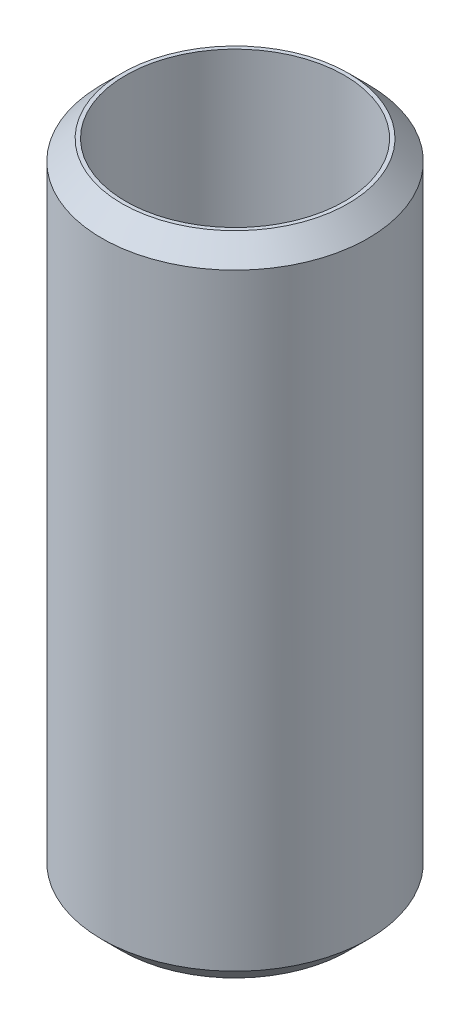
ISO-10303-21;
HEADER;
FILE_DESCRIPTION(('STEP AP214'),'2;1');
FILE_NAME('part.step','',(''),(''),'','','');
FILE_SCHEMA(('AUTOMOTIVE_DESIGN { 1 0 10303 214 1 1 1 1 }'));
ENDSEC;
DATA;
#1=APPLICATION_CONTEXT('core data for automotive mechanical design processes');
#2=APPLICATION_PROTOCOL_DEFINITION('international standard','automotive_design',2000,#1);
#3=PRODUCT_CONTEXT('',#1,'mechanical');
#4=PRODUCT('Part','Part','',(#3));
#5=PRODUCT_RELATED_PRODUCT_CATEGORY('part','',(#4));
#6=PRODUCT_DEFINITION_FORMATION('','',#4);
#7=PRODUCT_DEFINITION_CONTEXT('part definition',#1,'design');
#8=PRODUCT_DEFINITION('design','',#6,#7);
#9=PRODUCT_DEFINITION_SHAPE('','',#8);
#10=(LENGTH_UNIT() NAMED_UNIT(*) SI_UNIT(.MILLI.,.METRE.));
#11=(NAMED_UNIT(*) PLANE_ANGLE_UNIT() SI_UNIT($,.RADIAN.));
#12=(NAMED_UNIT(*) SI_UNIT($,.STERADIAN.) SOLID_ANGLE_UNIT());
#13=UNCERTAINTY_MEASURE_WITH_UNIT(LENGTH_MEASURE(1.E-05),#10,'distance_accuracy_value','');
#14=(GEOMETRIC_REPRESENTATION_CONTEXT(3) GLOBAL_UNCERTAINTY_ASSIGNED_CONTEXT((#13)) GLOBAL_UNIT_ASSIGNED_CONTEXT((#10,
#11,#12)) REPRESENTATION_CONTEXT('',''));
#15=CARTESIAN_POINT('',(0.,0.,0.));
#16=DIRECTION('',(0.,0.,1.));
#17=DIRECTION('',(1.,0.,0.));
#18=AXIS2_PLACEMENT_3D('',#15,#16,#17);
#19=CARTESIAN_POINT('',(0.,145.82505230772,0.));
#20=DIRECTION('',(0.,-1.,0.));
#21=DIRECTION('',(0.,0.,-1.));
#22=AXIS2_PLACEMENT_3D('',#19,#20,#21);
#23=CYLINDRICAL_SURFACE('',#22,30.);
#24=CARTESIAN_POINT('',(0.,141.311766503495,0.));
#25=DIRECTION('',(0.,1.,0.));
#26=DIRECTION('',(0.,0.,1.));
#27=AXIS2_PLACEMENT_3D('',#24,#25,#26);
#28=CIRCLE('',#27,30.);
#29=CARTESIAN_POINT('',(0.,141.311766503495,-30.));
#30=VERTEX_POINT('',#29);
#31=EDGE_CURVE('E50',#30,#30,#28,.F.);
#32=CARTESIAN_POINT('',(0.,4.51328580422547,0.));
#33=DIRECTION('',(0.,1.,0.));
#34=DIRECTION('',(0.,0.,1.));
#35=AXIS2_PLACEMENT_3D('',#32,#33,#34);
#36=CIRCLE('',#35,30.);
#37=CARTESIAN_POINT('',(0.,4.51328580422544,-30.));
#38=VERTEX_POINT('',#37);
#39=EDGE_CURVE('E51',#38,#38,#36,.T.);
#40=CARTESIAN_POINT('',(0.,141.311766503495,-30.));
#41=CARTESIAN_POINT('',(0.,139.886782329544,-30.));
#42=CARTESIAN_POINT('',(0.,138.461798155593,-30.));
#43=CARTESIAN_POINT('',(0.,135.611829807692,-30.));
#44=CARTESIAN_POINT('',(0.,134.186845633741,-30.));
#45=CARTESIAN_POINT('',(0.,131.33687728584,-30.));
#46=CARTESIAN_POINT('',(0.,129.911893111889,-30.));
#47=CARTESIAN_POINT('',(0.,127.061924763987,-30.));
#48=CARTESIAN_POINT('',(0.,125.636940590037,-30.));
#49=CARTESIAN_POINT('',(0.,122.786972242135,-30.));
#50=CARTESIAN_POINT('',(0.,121.361988068184,-30.));
#51=CARTESIAN_POINT('',(0.,118.512019720283,-30.));
#52=CARTESIAN_POINT('',(0.,117.087035546332,-30.));
#53=CARTESIAN_POINT('',(0.,114.237067198431,-30.));
#54=CARTESIAN_POINT('',(0.,112.81208302448,-30.));
#55=CARTESIAN_POINT('',(0.,109.962114676579,-30.));
#56=CARTESIAN_POINT('',(0.,108.537130502628,-30.));
#57=CARTESIAN_POINT('',(0.,105.687162154727,-30.));
#58=CARTESIAN_POINT('',(0.,104.262177980776,-30.));
#59=CARTESIAN_POINT('',(0.,101.412209632874,-30.));
#60=CARTESIAN_POINT('',(0.,99.9872254589237,-30.));
#61=CARTESIAN_POINT('',(0.,97.1372571110222,-30.));
#62=CARTESIAN_POINT('',(0.,95.7122729370715,-30.));
#63=CARTESIAN_POINT('',(0.,92.8623045891701,-30.));
#64=CARTESIAN_POINT('',(0.,91.4373204152193,-30.));
#65=CARTESIAN_POINT('',(0.,88.5873520673179,-30.));
#66=CARTESIAN_POINT('',(0.,87.1623678933672,-30.));
#67=CARTESIAN_POINT('',(0.,84.3123995454658,-30.));
#68=CARTESIAN_POINT('',(0.,82.887415371515,-30.));
#69=CARTESIAN_POINT('',(0.,80.0374470236136,-30.));
#70=CARTESIAN_POINT('',(0.,78.6124628496629,-30.));
#71=CARTESIAN_POINT('',(0.,75.7624945017614,-30.));
#72=CARTESIAN_POINT('',(0.,74.3375103278107,-30.));
#73=CARTESIAN_POINT('',(0.,71.4875419799093,-30.));
#74=CARTESIAN_POINT('',(0.,70.0625578059585,-30.));
#75=CARTESIAN_POINT('',(0.,67.2125894580571,-30.));
#76=CARTESIAN_POINT('',(0.,65.7876052841064,-30.));
#77=CARTESIAN_POINT('',(0.,62.937636936205,-30.));
#78=CARTESIAN_POINT('',(0.,61.5126527622542,-30.));
#79=CARTESIAN_POINT('',(0.,58.6626844143528,-30.));
#80=CARTESIAN_POINT('',(0.,57.2377002404021,-30.));
#81=CARTESIAN_POINT('',(0.,54.3877318925006,-30.));
#82=CARTESIAN_POINT('',(0.,52.9627477185499,-30.));
#83=CARTESIAN_POINT('',(0.,50.1127793706485,-30.));
#84=CARTESIAN_POINT('',(0.,48.6877951966977,-30.));
#85=CARTESIAN_POINT('',(0.,45.8378268487963,-30.));
#86=CARTESIAN_POINT('',(0.,44.4128426748456,-30.));
#87=CARTESIAN_POINT('',(0.,41.5628743269441,-30.));
#88=CARTESIAN_POINT('',(0.,40.1378901529934,-30.));
#89=CARTESIAN_POINT('',(0.,37.287921805092,-30.));
#90=CARTESIAN_POINT('',(0.,35.8629376311413,-30.));
#91=CARTESIAN_POINT('',(0.,33.0129692832398,-30.));
#92=CARTESIAN_POINT('',(0.,31.5879851092891,-30.));
#93=CARTESIAN_POINT('',(0.,28.7380167613877,-30.));
#94=CARTESIAN_POINT('',(0.,27.3130325874369,-30.));
#95=CARTESIAN_POINT('',(0.,24.4630642395355,-30.));
#96=CARTESIAN_POINT('',(0.,23.0380800655848,-30.));
#97=CARTESIAN_POINT('',(0.,20.1881117176833,-30.));
#98=CARTESIAN_POINT('',(0.,18.7631275437326,-30.));
#99=CARTESIAN_POINT('',(0.,15.9131591958312,-30.));
#100=CARTESIAN_POINT('',(0.,14.4881750218805,-30.));
#101=CARTESIAN_POINT('',(0.,11.638206673979,-30.));
#102=CARTESIAN_POINT('',(0.,10.2132225000283,-30.));
#103=CARTESIAN_POINT('',(0.,7.36325415212689,-30.));
#104=CARTESIAN_POINT('',(0.,5.93826997817617,-30.));
#105=CARTESIAN_POINT('',(0.,4.51328580422544,-30.));
#106=B_SPLINE_CURVE_WITH_KNOTS('',3,(#40,#41,#42,#43,#44,#45,#46,#47,#48,#49,#50,#51,#52,#53,
#54,#55,#56,#57,#58,#59,#60,#61,#62,#63,#64,#65,#66,#67,#68,#69,#70,#71,#72,#73,#74,#75,#76,#77,
#78,#79,#80,#81,#82,#83,#84,#85,#86,#87,#88,#89,#90,#91,#92,#93,#94,#95,#96,#97,#98,#99,#100,
#101,#102,#103,#104,#105),.UNSPECIFIED.,.F.,.F.,(4,2,2,2,2,2,2,2,2,2,2,2,2,2,2,2,2,2,2,2,2,2,2,
2,2,2,2,2,2,2,2,2,4),(0.,4.27495252185217,8.54990504370434,12.8248575655565,17.0998100874087,
21.3747626092608,25.649715131113,29.9246676529651,34.1996201748173,38.4745726966695,
42.7495252185216,47.0244777403738,51.2994302622259,55.5743827840781,59.8493353059302,
64.1242878277824,68.3992403496346,72.6741928714867,76.9491453933389,81.2240979151911,
85.4990504370432,89.7740029588954,94.0489554807475,98.3239080025997,102.598860524452,
106.873813046304,111.148765568156,115.423718090008,119.69867061186,123.973623133713,
128.248575655565,132.523528177417,136.798480699269),.UNSPECIFIED.);
#107=EDGE_CURVE('BSEAM39',#30,#38,#106,.T.);
#108=ORIENTED_EDGE('',*,*,#31,.T.);
#109=ORIENTED_EDGE('',*,*,#39,.T.);
#110=ORIENTED_EDGE('',*,*,#107,.T.);
#111=ORIENTED_EDGE('',*,*,#107,.F.);
#112=EDGE_LOOP('',(#108,#110,#109,#111));
#113=FACE_BOUND('',#112,.T.);
#114=ADVANCED_FACE('F39',(#113),#23,.T.);
#115=CARTESIAN_POINT('',(0.,145.82505230772,0.));
#116=DIRECTION('',(0.,1.,0.));
#117=DIRECTION('',(0.,0.,1.));
#118=AXIS2_PLACEMENT_3D('',#115,#116,#117);
#119=PLANE('',#118);
#120=CARTESIAN_POINT('',(0.,145.82505230772,0.));
#121=DIRECTION('',(0.,1.,0.));
#122=DIRECTION('',(0.,0.,1.));
#123=AXIS2_PLACEMENT_3D('',#120,#121,#122);
#124=CIRCLE('',#123,25.4867141957748);
#125=CARTESIAN_POINT('',(0.,145.82505230772,25.4867141957748));
#126=VERTEX_POINT('',#125);
#127=EDGE_CURVE('E54',#126,#126,#124,.T.);
#128=ORIENTED_EDGE('',*,*,#127,.T.);
#129=EDGE_LOOP('',(#128));
#130=FACE_BOUND('',#129,.T.);
#131=CARTESIAN_POINT('',(0.,145.82505230772,0.));
#132=DIRECTION('',(0.,1.,0.));
#133=DIRECTION('',(0.,0.,1.));
#134=AXIS2_PLACEMENT_3D('',#131,#132,#133);
#135=CIRCLE('',#134,24.6259979879535);
#136=CARTESIAN_POINT('',(0.,145.82505230772,-24.6259979879535));
#137=VERTEX_POINT('',#136);
#138=EDGE_CURVE('E58',#137,#137,#135,.T.);
#139=ORIENTED_EDGE('',*,*,#138,.F.);
#140=EDGE_LOOP('',(#139));
#141=FACE_BOUND('',#140,.T.);
#142=ADVANCED_FACE('F69',(#130,#141),#119,.T.);
#143=CARTESIAN_POINT('',(0.,0.,0.));
#144=DIRECTION('',(0.,1.,0.));
#145=DIRECTION('',(0.,0.,1.));
#146=AXIS2_PLACEMENT_3D('',#143,#144,#145);
#147=PLANE('',#146);
#148=CARTESIAN_POINT('',(0.,0.,0.));
#149=DIRECTION('',(0.,1.,0.));
#150=DIRECTION('',(0.,0.,1.));
#151=AXIS2_PLACEMENT_3D('',#148,#149,#150);
#152=CIRCLE('',#151,25.4867141957745);
#153=CARTESIAN_POINT('',(0.,0.,25.4867141957745));
#154=VERTEX_POINT('',#153);
#155=EDGE_CURVE('E10',#154,#154,#152,.F.);
#156=ORIENTED_EDGE('',*,*,#155,.T.);
#157=EDGE_LOOP('',(#156));
#158=FACE_BOUND('',#157,.T.);
#159=CARTESIAN_POINT('',(0.,0.,0.));
#160=DIRECTION('',(0.,1.,0.));
#161=DIRECTION('',(0.,0.,1.));
#162=AXIS2_PLACEMENT_3D('',#159,#160,#161);
#163=CIRCLE('',#162,24.6259979879535);
#164=CARTESIAN_POINT('',(0.,0.,-24.6259979879535));
#165=VERTEX_POINT('',#164);
#166=EDGE_CURVE('E63',#165,#165,#163,.T.);
#167=ORIENTED_EDGE('',*,*,#166,.T.);
#168=EDGE_LOOP('',(#167));
#169=FACE_BOUND('',#168,.T.);
#170=ADVANCED_FACE('F75',(#158,#169),#147,.F.);
#171=CARTESIAN_POINT('',(0.,145.82505230772,0.));
#172=DIRECTION('',(0.,-1.,0.));
#173=DIRECTION('',(0.,0.,-1.));
#174=AXIS2_PLACEMENT_3D('',#171,#172,#173);
#175=CYLINDRICAL_SURFACE('',#174,24.6259979879535);
#176=CARTESIAN_POINT('',(0.,145.82505230772,-24.6259979879535));
#177=CARTESIAN_POINT('',(0.,144.306041346181,-24.6259979879535));
#178=CARTESIAN_POINT('',(0.,142.787030384642,-24.6259979879535));
#179=CARTESIAN_POINT('',(0.,139.749008461565,-24.6259979879535));
#180=CARTESIAN_POINT('',(0.,138.229997500026,-24.6259979879535));
#181=CARTESIAN_POINT('',(0.,135.191975576949,-24.6259979879535));
#182=CARTESIAN_POINT('',(0.,133.67296461541,-24.6259979879535));
#183=CARTESIAN_POINT('',(0.,130.634942692332,-24.6259979879535));
#184=CARTESIAN_POINT('',(0.,129.115931730794,-24.6259979879535));
#185=CARTESIAN_POINT('',(0.,126.077909807716,-24.6259979879535));
#186=CARTESIAN_POINT('',(0.,124.558898846177,-24.6259979879535));
#187=CARTESIAN_POINT('',(0.,121.5208769231,-24.6259979879535));
#188=CARTESIAN_POINT('',(0.,120.001865961561,-24.6259979879535));
#189=CARTESIAN_POINT('',(0.,116.963844038484,-24.6259979879535));
#190=CARTESIAN_POINT('',(0.,115.444833076945,-24.6259979879535));
#191=CARTESIAN_POINT('',(0.,112.406811153867,-24.6259979879535));
#192=CARTESIAN_POINT('',(0.,110.887800192329,-24.6259979879535));
#193=CARTESIAN_POINT('',(0.,107.849778269251,-24.6259979879535));
#194=CARTESIAN_POINT('',(0.,106.330767307712,-24.6259979879535));
#195=CARTESIAN_POINT('',(0.,103.292745384635,-24.6259979879535));
#196=CARTESIAN_POINT('',(0.,101.773734423096,-24.6259979879535));
#197=CARTESIAN_POINT('',(0.,98.7357125000186,-24.6259979879535));
#198=CARTESIAN_POINT('',(0.,97.2167015384799,-24.6259979879535));
#199=CARTESIAN_POINT('',(0.,94.1786796154024,-24.6259979879535));
#200=CARTESIAN_POINT('',(0.,92.6596686538636,-24.6259979879535));
#201=CARTESIAN_POINT('',(0.,89.6216467307861,-24.6259979879535));
#202=CARTESIAN_POINT('',(0.,88.1026357692474,-24.6259979879535));
#203=CARTESIAN_POINT('',(0.,85.0646138461699,-24.6259979879535));
#204=CARTESIAN_POINT('',(0.,83.5456028846311,-24.6259979879535));
#205=CARTESIAN_POINT('',(0.,80.5075809615536,-24.6259979879535));
#206=CARTESIAN_POINT('',(0.,78.9885700000149,-24.6259979879535));
#207=CARTESIAN_POINT('',(0.,75.9505480769374,-24.6259979879535));
#208=CARTESIAN_POINT('',(0.,74.4315371153987,-24.6259979879535));
#209=CARTESIAN_POINT('',(0.,71.3935151923211,-24.6259979879535));
#210=CARTESIAN_POINT('',(0.,69.8745042307824,-24.6259979879535));
#211=CARTESIAN_POINT('',(0.,66.8364823077049,-24.6259979879535));
#212=CARTESIAN_POINT('',(0.,65.3174713461662,-24.6259979879535));
#213=CARTESIAN_POINT('',(0.,62.2794494230887,-24.6259979879535));
#214=CARTESIAN_POINT('',(0.,60.7604384615499,-24.6259979879535));
#215=CARTESIAN_POINT('',(0.,57.7224165384724,-24.6259979879535));
#216=CARTESIAN_POINT('',(0.,56.2034055769337,-24.6259979879535));
#217=CARTESIAN_POINT('',(0.,53.1653836538562,-24.6259979879535));
#218=CARTESIAN_POINT('',(0.,51.6463726923174,-24.6259979879535));
#219=CARTESIAN_POINT('',(0.,48.6083507692399,-24.6259979879535));
#220=CARTESIAN_POINT('',(0.,47.0893398077012,-24.6259979879535));
#221=CARTESIAN_POINT('',(0.,44.0513178846237,-24.6259979879535));
#222=CARTESIAN_POINT('',(0.,42.5323069230849,-24.6259979879535));
#223=CARTESIAN_POINT('',(0.,39.4942850000074,-24.6259979879535));
#224=CARTESIAN_POINT('',(0.,37.9752740384687,-24.6259979879535));
#225=CARTESIAN_POINT('',(0.,34.9372521153912,-24.6259979879535));
#226=CARTESIAN_POINT('',(0.,33.4182411538524,-24.6259979879535));
#227=CARTESIAN_POINT('',(0.,30.3802192307749,-24.6259979879535));
#228=CARTESIAN_POINT('',(0.,28.8612082692362,-24.6259979879535));
#229=CARTESIAN_POINT('',(0.,25.8231863461587,-24.6259979879535));
#230=CARTESIAN_POINT('',(0.,24.30417538462,-24.6259979879535));
#231=CARTESIAN_POINT('',(0.,21.2661534615425,-24.6259979879535));
#232=CARTESIAN_POINT('',(0.,19.7471425000037,-24.6259979879535));
#233=CARTESIAN_POINT('',(0.,16.7091205769262,-24.6259979879535));
#234=CARTESIAN_POINT('',(0.,15.1901096153875,-24.6259979879535));
#235=CARTESIAN_POINT('',(0.,12.15208769231,-24.6259979879535));
#236=CARTESIAN_POINT('',(0.,10.6330767307712,-24.6259979879535));
#237=CARTESIAN_POINT('',(0.,7.59505480769374,-24.6259979879535));
#238=CARTESIAN_POINT('',(0.,6.076043846155,-24.6259979879535));
#239=CARTESIAN_POINT('',(0.,3.0380219230775,-24.6259979879535));
#240=CARTESIAN_POINT('',(0.,1.51901096153875,-24.6259979879535));
#241=CARTESIAN_POINT('',(0.,0.,-24.6259979879535));
#242=B_SPLINE_CURVE_WITH_KNOTS('',3,(#176,#177,#178,#179,#180,#181,#182,#183,#184,#185,#186,
#187,#188,#189,#190,#191,#192,#193,#194,#195,#196,#197,#198,#199,#200,#201,#202,#203,#204,#205,
#206,#207,#208,#209,#210,#211,#212,#213,#214,#215,#216,#217,#218,#219,#220,#221,#222,#223,#224,
#225,#226,#227,#228,#229,#230,#231,#232,#233,#234,#235,#236,#237,#238,#239,#240,#241),
.UNSPECIFIED.,.F.,.F.,(4,2,2,2,2,2,2,2,2,2,2,2,2,2,2,2,2,2,2,2,2,2,2,2,2,2,2,2,2,2,2,2,4),(0.,
4.55703288461626,9.11406576923252,13.6710986538487,18.228131538465,22.7851644230812,
27.3421973076975,31.8992301923137,36.45626307693,41.0132959615462,45.5703288461625,
50.1273617307787,54.684394615395,59.2414275000112,63.7984603846274,68.3554932692437,
72.9125261538599,77.4695590384762,82.0265919230924,86.5836248077087,91.1406576923249,
95.6976905769412,100.254723461557,104.811756346174,109.36878923079,113.925822115406,
118.482855000022,123.039887884639,127.596920769255,132.153953653871,136.710986538487,
141.268019423104,145.82505230772),.UNSPECIFIED.);
#243=EDGE_CURVE('BSEAM70',#137,#165,#242,.T.);
#244=ORIENTED_EDGE('',*,*,#138,.T.);
#245=ORIENTED_EDGE('',*,*,#166,.F.);
#246=ORIENTED_EDGE('',*,*,#243,.T.);
#247=ORIENTED_EDGE('',*,*,#243,.F.);
#248=EDGE_LOOP('',(#244,#246,#245,#247));
#249=FACE_BOUND('',#248,.T.);
#250=ADVANCED_FACE('F70',(#249),#175,.F.);
#251=CARTESIAN_POINT('',(0.,145.82505230772,0.));
#252=DIRECTION('',(0.,-1.,0.));
#253=DIRECTION('',(0.,0.,-1.));
#254=AXIS2_PLACEMENT_3D('',#251,#252,#253);
#255=CONICAL_SURFACE('',#254,25.4867141957748,0.785398163397444);
#256=ORIENTED_EDGE('',*,*,#31,.F.);
#257=EDGE_LOOP('',(#256));
#258=FACE_BOUND('',#257,.T.);
#259=ORIENTED_EDGE('',*,*,#127,.F.);
#260=EDGE_LOOP('',(#259));
#261=FACE_BOUND('',#260,.T.);
#262=ADVANCED_FACE('F81',(#258,#261),#255,.T.);
#263=CARTESIAN_POINT('',(0.,4.51328580422544,0.));
#264=DIRECTION('',(0.,1.,0.));
#265=DIRECTION('',(0.,0.,1.));
#266=AXIS2_PLACEMENT_3D('',#263,#264,#265);
#267=CONICAL_SURFACE('',#266,30.,0.785398163397454);
#268=ORIENTED_EDGE('',*,*,#155,.F.);
#269=EDGE_LOOP('',(#268));
#270=FACE_BOUND('',#269,.T.);
#271=ORIENTED_EDGE('',*,*,#39,.F.);
#272=EDGE_LOOP('',(#271));
#273=FACE_BOUND('',#272,.T.);
#274=ADVANCED_FACE('F45',(#270,#273),#267,.T.);
#275=CLOSED_SHELL('',(#114,#142,#170,#250,#262,#274));
#276=MANIFOLD_SOLID_BREP('B2',#275);
#277=ADVANCED_BREP_SHAPE_REPRESENTATION('',(#18,#276),#14);
#278=SHAPE_DEFINITION_REPRESENTATION(#9,#277);
ENDSEC;
END-ISO-10303-21;
